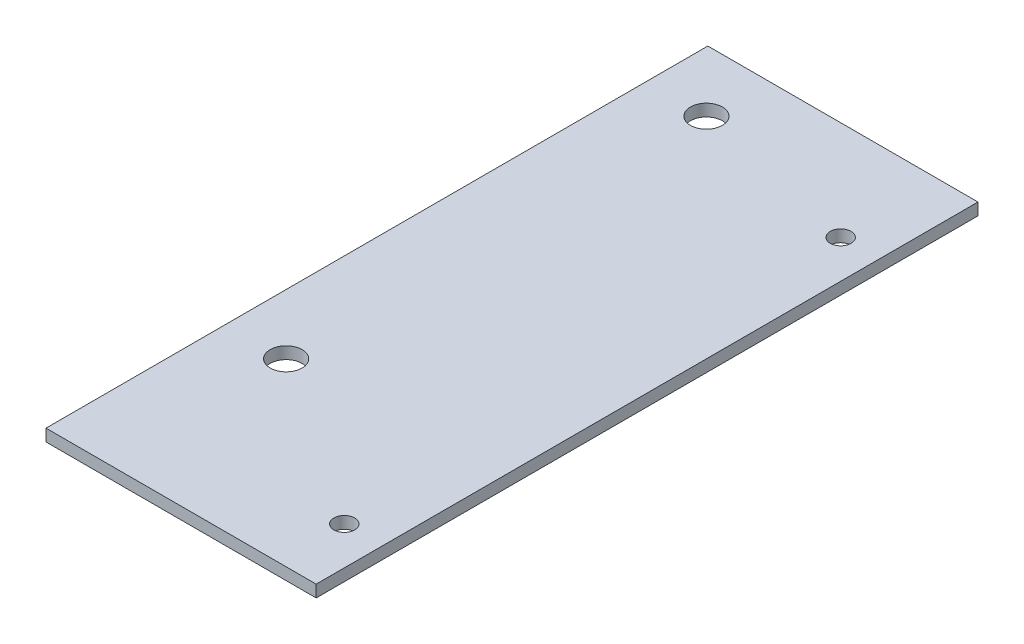
ISO-10303-21;
HEADER;
FILE_DESCRIPTION(('STEP AP214'),'2;1');
FILE_NAME('part.step','',(''),(''),'','','');
FILE_SCHEMA(('AUTOMOTIVE_DESIGN { 1 0 10303 214 1 1 1 1 }'));
ENDSEC;
DATA;
#1=APPLICATION_CONTEXT('core data for automotive mechanical design processes');
#2=APPLICATION_PROTOCOL_DEFINITION('international standard','automotive_design',2000,#1);
#3=PRODUCT_CONTEXT('',#1,'mechanical');
#4=PRODUCT('Part','Part','',(#3));
#5=PRODUCT_RELATED_PRODUCT_CATEGORY('part','',(#4));
#6=PRODUCT_DEFINITION_FORMATION('','',#4);
#7=PRODUCT_DEFINITION_CONTEXT('part definition',#1,'design');
#8=PRODUCT_DEFINITION('design','',#6,#7);
#9=PRODUCT_DEFINITION_SHAPE('','',#8);
#10=(LENGTH_UNIT() NAMED_UNIT(*) SI_UNIT(.MILLI.,.METRE.));
#11=(NAMED_UNIT(*) PLANE_ANGLE_UNIT() SI_UNIT($,.RADIAN.));
#12=(NAMED_UNIT(*) SI_UNIT($,.STERADIAN.) SOLID_ANGLE_UNIT());
#13=UNCERTAINTY_MEASURE_WITH_UNIT(LENGTH_MEASURE(1.E-05),#10,'distance_accuracy_value','');
#14=(GEOMETRIC_REPRESENTATION_CONTEXT(3) GLOBAL_UNCERTAINTY_ASSIGNED_CONTEXT((#13)) GLOBAL_UNIT_ASSIGNED_CONTEXT((#10,
#11,#12)) REPRESENTATION_CONTEXT('',''));
#15=CARTESIAN_POINT('',(0.,0.,0.));
#16=DIRECTION('',(0.,0.,1.));
#17=DIRECTION('',(1.,0.,0.));
#18=AXIS2_PLACEMENT_3D('',#15,#16,#17);
#19=CARTESIAN_POINT('',(0.,2.54,0.));
#20=DIRECTION('',(1.,0.,0.));
#21=DIRECTION('',(0.,0.,-1.));
#22=AXIS2_PLACEMENT_3D('',#19,#20,#21);
#23=PLANE('',#22);
#24=DIRECTION('',(0.,0.,1.));
#25=VECTOR('',#24,1.);
#26=CARTESIAN_POINT('',(0.,0.,0.));
#27=LINE('',#26,#25);
#28=CARTESIAN_POINT('',(0.,0.,-140.));
#29=VERTEX_POINT('',#28);
#30=CARTESIAN_POINT('',(0.,0.,0.));
#31=VERTEX_POINT('',#30);
#32=EDGE_CURVE('E98',#29,#31,#27,.T.);
#33=ORIENTED_EDGE('',*,*,#32,.T.);
#34=DIRECTION('',(0.,-1.,0.));
#35=VECTOR('',#34,1.);
#36=CARTESIAN_POINT('',(0.,2.54,0.));
#37=LINE('',#36,#35);
#38=CARTESIAN_POINT('',(0.,2.54,0.));
#39=VERTEX_POINT('',#38);
#40=EDGE_CURVE('E11',#39,#31,#37,.T.);
#41=ORIENTED_EDGE('',*,*,#40,.F.);
#42=DIRECTION('',(0.,0.,1.));
#43=VECTOR('',#42,1.);
#44=CARTESIAN_POINT('',(0.,2.54,0.));
#45=LINE('',#44,#43);
#46=CARTESIAN_POINT('',(0.,2.54,-140.));
#47=VERTEX_POINT('',#46);
#48=EDGE_CURVE('E85',#47,#39,#45,.T.);
#49=ORIENTED_EDGE('',*,*,#48,.F.);
#50=DIRECTION('',(0.,-1.,0.));
#51=VECTOR('',#50,1.);
#52=CARTESIAN_POINT('',(0.,2.54,-140.));
#53=LINE('',#52,#51);
#54=EDGE_CURVE('E94',#47,#29,#53,.T.);
#55=ORIENTED_EDGE('',*,*,#54,.T.);
#56=EDGE_LOOP('',(#33,#41,#49,#55));
#57=FACE_BOUND('',#56,.T.);
#58=ADVANCED_FACE('F32',(#57),#23,.F.);
#59=CARTESIAN_POINT('',(0.,2.54,0.));
#60=DIRECTION('',(0.,0.,-1.));
#61=DIRECTION('',(-1.,0.,0.));
#62=AXIS2_PLACEMENT_3D('',#59,#60,#61);
#63=PLANE('',#62);
#64=DIRECTION('',(1.,0.,0.));
#65=VECTOR('',#64,1.);
#66=CARTESIAN_POINT('',(0.,0.,0.));
#67=LINE('',#66,#65);
#68=CARTESIAN_POINT('',(57.15,0.,0.));
#69=VERTEX_POINT('',#68);
#70=EDGE_CURVE('E89',#31,#69,#67,.T.);
#71=ORIENTED_EDGE('',*,*,#70,.T.);
#72=DIRECTION('',(0.,-1.,0.));
#73=VECTOR('',#72,1.);
#74=CARTESIAN_POINT('',(57.15,2.54,0.));
#75=LINE('',#74,#73);
#76=CARTESIAN_POINT('',(57.15,2.54,0.));
#77=VERTEX_POINT('',#76);
#78=EDGE_CURVE('E41',#77,#69,#75,.T.);
#79=ORIENTED_EDGE('',*,*,#78,.F.);
#80=DIRECTION('',(1.,0.,0.));
#81=VECTOR('',#80,1.);
#82=CARTESIAN_POINT('',(0.,2.54,0.));
#83=LINE('',#82,#81);
#84=EDGE_CURVE('E80',#39,#77,#83,.T.);
#85=ORIENTED_EDGE('',*,*,#84,.F.);
#86=ORIENTED_EDGE('',*,*,#40,.T.);
#87=EDGE_LOOP('',(#71,#79,#85,#86));
#88=FACE_BOUND('',#87,.T.);
#89=ADVANCED_FACE('F88',(#88),#63,.F.);
#90=CARTESIAN_POINT('',(57.15,2.54,0.));
#91=DIRECTION('',(-1.,0.,0.));
#92=DIRECTION('',(0.,0.,1.));
#93=AXIS2_PLACEMENT_3D('',#90,#91,#92);
#94=PLANE('',#93);
#95=DIRECTION('',(0.,0.,-1.));
#96=VECTOR('',#95,1.);
#97=CARTESIAN_POINT('',(57.15,0.,0.));
#98=LINE('',#97,#96);
#99=CARTESIAN_POINT('',(57.15,0.,-140.));
#100=VERTEX_POINT('',#99);
#101=EDGE_CURVE('E67',#69,#100,#98,.T.);
#102=ORIENTED_EDGE('',*,*,#101,.T.);
#103=DIRECTION('',(0.,-1.,0.));
#104=VECTOR('',#103,1.);
#105=CARTESIAN_POINT('',(57.15,2.54,-140.));
#106=LINE('',#105,#104);
#107=CARTESIAN_POINT('',(57.15,2.54,-140.));
#108=VERTEX_POINT('',#107);
#109=EDGE_CURVE('E90',#108,#100,#106,.T.);
#110=ORIENTED_EDGE('',*,*,#109,.F.);
#111=DIRECTION('',(0.,0.,-1.));
#112=VECTOR('',#111,1.);
#113=CARTESIAN_POINT('',(57.15,2.54,0.));
#114=LINE('',#113,#112);
#115=EDGE_CURVE('E83',#77,#108,#114,.T.);
#116=ORIENTED_EDGE('',*,*,#115,.F.);
#117=ORIENTED_EDGE('',*,*,#78,.T.);
#118=EDGE_LOOP('',(#102,#110,#116,#117));
#119=FACE_BOUND('',#118,.T.);
#120=ADVANCED_FACE('F92',(#119),#94,.F.);
#121=CARTESIAN_POINT('',(0.,2.54,-140.));
#122=DIRECTION('',(0.,0.,1.));
#123=DIRECTION('',(1.,0.,0.));
#124=AXIS2_PLACEMENT_3D('',#121,#122,#123);
#125=PLANE('',#124);
#126=DIRECTION('',(-1.,0.,0.));
#127=VECTOR('',#126,1.);
#128=CARTESIAN_POINT('',(0.,0.,-140.));
#129=LINE('',#128,#127);
#130=EDGE_CURVE('E73',#100,#29,#129,.T.);
#131=ORIENTED_EDGE('',*,*,#130,.T.);
#132=ORIENTED_EDGE('',*,*,#54,.F.);
#133=DIRECTION('',(-1.,0.,0.));
#134=VECTOR('',#133,1.);
#135=CARTESIAN_POINT('',(0.,2.54,-140.));
#136=LINE('',#135,#134);
#137=EDGE_CURVE('E50',#108,#47,#136,.T.);
#138=ORIENTED_EDGE('',*,*,#137,.F.);
#139=ORIENTED_EDGE('',*,*,#109,.T.);
#140=EDGE_LOOP('',(#131,#132,#138,#139));
#141=FACE_BOUND('',#140,.T.);
#142=ADVANCED_FACE('F140',(#141),#125,.F.);
#143=CARTESIAN_POINT('',(0.,2.54,0.));
#144=DIRECTION('',(0.,-1.,0.));
#145=DIRECTION('',(0.,0.,-1.));
#146=AXIS2_PLACEMENT_3D('',#143,#144,#145);
#147=PLANE('',#146);
#148=CARTESIAN_POINT('',(12.7000000000001,2.54,-38.1));
#149=DIRECTION('',(0.,-1.,0.));
#150=DIRECTION('',(0.,0.,-1.));
#151=AXIS2_PLACEMENT_3D('',#148,#149,#150);
#152=CIRCLE('',#151,3.3782);
#153=CARTESIAN_POINT('',(12.7000000000001,2.54,-41.4782));
#154=VERTEX_POINT('',#153);
#155=EDGE_CURVE('E120',#154,#154,#152,.T.);
#156=ORIENTED_EDGE('',*,*,#155,.T.);
#157=EDGE_LOOP('',(#156));
#158=FACE_BOUND('',#157,.T.);
#159=CARTESIAN_POINT('',(12.7000000000001,2.54,-127.));
#160=DIRECTION('',(0.,-1.,0.));
#161=DIRECTION('',(0.,0.,-1.));
#162=AXIS2_PLACEMENT_3D('',#159,#160,#161);
#163=CIRCLE('',#162,3.3782);
#164=CARTESIAN_POINT('',(12.7000000000001,2.54,-130.3782));
#165=VERTEX_POINT('',#164);
#166=EDGE_CURVE('E109',#165,#165,#163,.T.);
#167=ORIENTED_EDGE('',*,*,#166,.T.);
#168=EDGE_LOOP('',(#167));
#169=FACE_BOUND('',#168,.T.);
#170=CARTESIAN_POINT('',(49.1000000000002,2.54,-14.));
#171=DIRECTION('',(0.,-1.,0.));
#172=DIRECTION('',(0.,0.,-1.));
#173=AXIS2_PLACEMENT_3D('',#170,#171,#172);
#174=CIRCLE('',#173,2.2);
#175=CARTESIAN_POINT('',(49.1000000000002,2.54,-16.2));
#176=VERTEX_POINT('',#175);
#177=EDGE_CURVE('E113',#176,#176,#174,.T.);
#178=ORIENTED_EDGE('',*,*,#177,.T.);
#179=EDGE_LOOP('',(#178));
#180=FACE_BOUND('',#179,.T.);
#181=CARTESIAN_POINT('',(49.1000000000002,2.54,-119.));
#182=DIRECTION('',(0.,-1.,0.));
#183=DIRECTION('',(0.,0.,-1.));
#184=AXIS2_PLACEMENT_3D('',#181,#182,#183);
#185=CIRCLE('',#184,2.19999999999999);
#186=CARTESIAN_POINT('',(49.1000000000002,2.54,-121.2));
#187=VERTEX_POINT('',#186);
#188=EDGE_CURVE('E101',#187,#187,#185,.T.);
#189=ORIENTED_EDGE('',*,*,#188,.T.);
#190=EDGE_LOOP('',(#189));
#191=FACE_BOUND('',#190,.T.);
#192=ORIENTED_EDGE('',*,*,#48,.T.);
#193=ORIENTED_EDGE('',*,*,#84,.T.);
#194=ORIENTED_EDGE('',*,*,#115,.T.);
#195=ORIENTED_EDGE('',*,*,#137,.T.);
#196=EDGE_LOOP('',(#192,#193,#194,#195));
#197=FACE_BOUND('',#196,.T.);
#198=ADVANCED_FACE('F81',(#158,#169,#180,#191,#197),#147,.F.);
#199=CARTESIAN_POINT('',(0.,0.,0.));
#200=DIRECTION('',(0.,-1.,0.));
#201=DIRECTION('',(0.,0.,-1.));
#202=AXIS2_PLACEMENT_3D('',#199,#200,#201);
#203=PLANE('',#202);
#204=CARTESIAN_POINT('',(12.7000000000001,0.,-38.1));
#205=DIRECTION('',(0.,-1.,0.));
#206=DIRECTION('',(0.,0.,-1.));
#207=AXIS2_PLACEMENT_3D('',#204,#205,#206);
#208=CIRCLE('',#207,3.3782);
#209=CARTESIAN_POINT('',(12.7000000000001,0.,-41.4782));
#210=VERTEX_POINT('',#209);
#211=EDGE_CURVE('E35',#210,#210,#208,.T.);
#212=ORIENTED_EDGE('',*,*,#211,.F.);
#213=EDGE_LOOP('',(#212));
#214=FACE_BOUND('',#213,.T.);
#215=CARTESIAN_POINT('',(12.7000000000001,0.,-127.));
#216=DIRECTION('',(0.,-1.,0.));
#217=DIRECTION('',(0.,0.,-1.));
#218=AXIS2_PLACEMENT_3D('',#215,#216,#217);
#219=CIRCLE('',#218,3.3782);
#220=CARTESIAN_POINT('',(12.7000000000001,0.,-130.3782));
#221=VERTEX_POINT('',#220);
#222=EDGE_CURVE('E106',#221,#221,#219,.T.);
#223=ORIENTED_EDGE('',*,*,#222,.F.);
#224=EDGE_LOOP('',(#223));
#225=FACE_BOUND('',#224,.T.);
#226=CARTESIAN_POINT('',(49.1000000000002,0.,-14.));
#227=DIRECTION('',(0.,-1.,0.));
#228=DIRECTION('',(0.,0.,-1.));
#229=AXIS2_PLACEMENT_3D('',#226,#227,#228);
#230=CIRCLE('',#229,2.2);
#231=CARTESIAN_POINT('',(49.1000000000002,0.,-16.2));
#232=VERTEX_POINT('',#231);
#233=EDGE_CURVE('E108',#232,#232,#230,.T.);
#234=ORIENTED_EDGE('',*,*,#233,.F.);
#235=EDGE_LOOP('',(#234));
#236=FACE_BOUND('',#235,.T.);
#237=CARTESIAN_POINT('',(49.1000000000002,0.,-119.));
#238=DIRECTION('',(0.,-1.,0.));
#239=DIRECTION('',(0.,0.,-1.));
#240=AXIS2_PLACEMENT_3D('',#237,#238,#239);
#241=CIRCLE('',#240,2.19999999999999);
#242=CARTESIAN_POINT('',(49.1000000000002,0.,-121.2));
#243=VERTEX_POINT('',#242);
#244=EDGE_CURVE('E124',#243,#243,#241,.T.);
#245=ORIENTED_EDGE('',*,*,#244,.F.);
#246=EDGE_LOOP('',(#245));
#247=FACE_BOUND('',#246,.T.);
#248=ORIENTED_EDGE('',*,*,#32,.F.);
#249=ORIENTED_EDGE('',*,*,#130,.F.);
#250=ORIENTED_EDGE('',*,*,#101,.F.);
#251=ORIENTED_EDGE('',*,*,#70,.F.);
#252=EDGE_LOOP('',(#248,#249,#250,#251));
#253=FACE_BOUND('',#252,.T.);
#254=ADVANCED_FACE('F133',(#214,#225,#236,#247,#253),#203,.T.);
#255=CARTESIAN_POINT('',(49.1000000000002,2.54,-119.));
#256=DIRECTION('',(0.,-1.,0.));
#257=DIRECTION('',(0.,0.,-1.));
#258=AXIS2_PLACEMENT_3D('',#255,#256,#257);
#259=CYLINDRICAL_SURFACE('',#258,2.19999999999999);
#260=ORIENTED_EDGE('',*,*,#188,.F.);
#261=EDGE_LOOP('',(#260));
#262=FACE_BOUND('',#261,.T.);
#263=ORIENTED_EDGE('',*,*,#244,.T.);
#264=EDGE_LOOP('',(#263));
#265=FACE_BOUND('',#264,.T.);
#266=ADVANCED_FACE('F131',(#262,#265),#259,.F.);
#267=CARTESIAN_POINT('',(49.1000000000002,2.54,-14.));
#268=DIRECTION('',(0.,-1.,0.));
#269=DIRECTION('',(0.,0.,-1.));
#270=AXIS2_PLACEMENT_3D('',#267,#268,#269);
#271=CYLINDRICAL_SURFACE('',#270,2.2);
#272=ORIENTED_EDGE('',*,*,#177,.F.);
#273=EDGE_LOOP('',(#272));
#274=FACE_BOUND('',#273,.T.);
#275=ORIENTED_EDGE('',*,*,#233,.T.);
#276=EDGE_LOOP('',(#275));
#277=FACE_BOUND('',#276,.T.);
#278=ADVANCED_FACE('F174',(#274,#277),#271,.F.);
#279=CARTESIAN_POINT('',(12.7000000000001,2.54,-127.));
#280=DIRECTION('',(0.,-1.,0.));
#281=DIRECTION('',(0.,0.,-1.));
#282=AXIS2_PLACEMENT_3D('',#279,#280,#281);
#283=CYLINDRICAL_SURFACE('',#282,3.3782);
#284=ORIENTED_EDGE('',*,*,#222,.T.);
#285=EDGE_LOOP('',(#284));
#286=FACE_BOUND('',#285,.T.);
#287=ORIENTED_EDGE('',*,*,#166,.F.);
#288=EDGE_LOOP('',(#287));
#289=FACE_BOUND('',#288,.T.);
#290=ADVANCED_FACE('F185',(#286,#289),#283,.F.);
#291=CARTESIAN_POINT('',(12.7000000000001,2.54,-38.1));
#292=DIRECTION('',(0.,-1.,0.));
#293=DIRECTION('',(0.,0.,-1.));
#294=AXIS2_PLACEMENT_3D('',#291,#292,#293);
#295=CYLINDRICAL_SURFACE('',#294,3.3782);
#296=ORIENTED_EDGE('',*,*,#211,.T.);
#297=EDGE_LOOP('',(#296));
#298=FACE_BOUND('',#297,.T.);
#299=ORIENTED_EDGE('',*,*,#155,.F.);
#300=EDGE_LOOP('',(#299));
#301=FACE_BOUND('',#300,.T.);
#302=ADVANCED_FACE('F205',(#298,#301),#295,.F.);
#303=CLOSED_SHELL('',(#58,#89,#120,#142,#198,#254,#266,#278,#290,#302));
#304=MANIFOLD_SOLID_BREP('B2',#303);
#305=ADVANCED_BREP_SHAPE_REPRESENTATION('',(#18,#304),#14);
#306=SHAPE_DEFINITION_REPRESENTATION(#9,#305);
ENDSEC;
END-ISO-10303-21;
